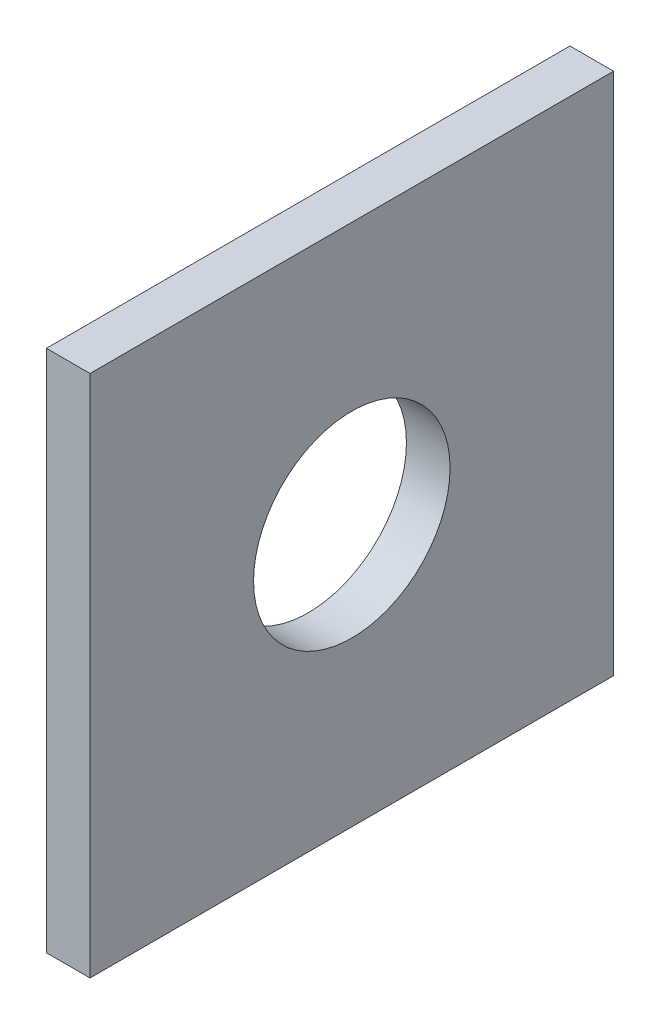
ISO-10303-21;
HEADER;
FILE_DESCRIPTION(('STEP AP214'),'2;1');
FILE_NAME('part.step','',(''),(''),'','','');
FILE_SCHEMA(('AUTOMOTIVE_DESIGN { 1 0 10303 214 1 1 1 1 }'));
ENDSEC;
DATA;
#1=APPLICATION_CONTEXT('core data for automotive mechanical design processes');
#2=APPLICATION_PROTOCOL_DEFINITION('international standard','automotive_design',2000,#1);
#3=PRODUCT_CONTEXT('',#1,'mechanical');
#4=PRODUCT('Part','Part','',(#3));
#5=PRODUCT_RELATED_PRODUCT_CATEGORY('part','',(#4));
#6=PRODUCT_DEFINITION_FORMATION('','',#4);
#7=PRODUCT_DEFINITION_CONTEXT('part definition',#1,'design');
#8=PRODUCT_DEFINITION('design','',#6,#7);
#9=PRODUCT_DEFINITION_SHAPE('','',#8);
#10=(LENGTH_UNIT() NAMED_UNIT(*) SI_UNIT(.MILLI.,.METRE.));
#11=(NAMED_UNIT(*) PLANE_ANGLE_UNIT() SI_UNIT($,.RADIAN.));
#12=(NAMED_UNIT(*) SI_UNIT($,.STERADIAN.) SOLID_ANGLE_UNIT());
#13=UNCERTAINTY_MEASURE_WITH_UNIT(LENGTH_MEASURE(1.E-05),#10,'distance_accuracy_value','');
#14=(GEOMETRIC_REPRESENTATION_CONTEXT(3) GLOBAL_UNCERTAINTY_ASSIGNED_CONTEXT((#13)) GLOBAL_UNIT_ASSIGNED_CONTEXT((#10,
#11,#12)) REPRESENTATION_CONTEXT('',''));
#15=CARTESIAN_POINT('',(0.,0.,0.));
#16=DIRECTION('',(0.,0.,1.));
#17=DIRECTION('',(1.,0.,0.));
#18=AXIS2_PLACEMENT_3D('',#15,#16,#17);
#19=CARTESIAN_POINT('',(-74.295,57.2820627876655,-19.05));
#20=DIRECTION('',(0.,0.,1.));
#21=DIRECTION('',(1.,0.,0.));
#22=AXIS2_PLACEMENT_3D('',#19,#20,#21);
#23=PLANE('',#22);
#24=DIRECTION('',(-1.,0.,0.));
#25=VECTOR('',#24,1.);
#26=CARTESIAN_POINT('',(-74.295,19.05,-19.05));
#27=LINE('',#26,#25);
#28=CARTESIAN_POINT('',(-71.12,19.05,-19.05));
#29=VERTEX_POINT('',#28);
#30=CARTESIAN_POINT('',(-74.295,19.05,-19.05));
#31=VERTEX_POINT('',#30);
#32=EDGE_CURVE('E106',#29,#31,#27,.T.);
#33=ORIENTED_EDGE('',*,*,#32,.F.);
#34=DIRECTION('',(0.,-1.,0.));
#35=VECTOR('',#34,1.);
#36=CARTESIAN_POINT('',(-71.12,57.2820627876655,-19.05));
#37=LINE('',#36,#35);
#38=CARTESIAN_POINT('',(-71.12,-19.05,-19.05));
#39=VERTEX_POINT('',#38);
#40=EDGE_CURVE('E43',#29,#39,#37,.T.);
#41=ORIENTED_EDGE('',*,*,#40,.T.);
#42=DIRECTION('',(1.,0.,0.));
#43=VECTOR('',#42,1.);
#44=CARTESIAN_POINT('',(-74.295,-19.05,-19.05));
#45=LINE('',#44,#43);
#46=CARTESIAN_POINT('',(-74.295,-19.05,-19.05));
#47=VERTEX_POINT('',#46);
#48=EDGE_CURVE('E100',#47,#39,#45,.T.);
#49=ORIENTED_EDGE('',*,*,#48,.F.);
#50=DIRECTION('',(0.,-1.,0.));
#51=VECTOR('',#50,1.);
#52=CARTESIAN_POINT('',(-74.295,57.2820627876655,-19.05));
#53=LINE('',#52,#51);
#54=EDGE_CURVE('E88',#31,#47,#53,.T.);
#55=ORIENTED_EDGE('',*,*,#54,.F.);
#56=EDGE_LOOP('',(#33,#41,#49,#55));
#57=FACE_BOUND('',#56,.T.);
#58=ADVANCED_FACE('F39',(#57),#23,.F.);
#59=CARTESIAN_POINT('',(-74.295,57.2820627876655,-19.05));
#60=DIRECTION('',(1.,0.,0.));
#61=DIRECTION('',(0.,0.,-1.));
#62=AXIS2_PLACEMENT_3D('',#59,#60,#61);
#63=PLANE('',#62);
#64=CARTESIAN_POINT('',(-74.295,0.,0.));
#65=DIRECTION('',(1.,0.,0.));
#66=DIRECTION('',(0.,0.,-1.));
#67=AXIS2_PLACEMENT_3D('',#64,#65,#66);
#68=CIRCLE('',#67,7.1501);
#69=CARTESIAN_POINT('',(-74.295,0.,-7.1501));
#70=VERTEX_POINT('',#69);
#71=EDGE_CURVE('E97',#70,#70,#68,.F.);
#72=ORIENTED_EDGE('',*,*,#71,.F.);
#73=EDGE_LOOP('',(#72));
#74=FACE_BOUND('',#73,.T.);
#75=DIRECTION('',(0.,0.,1.));
#76=VECTOR('',#75,1.);
#77=CARTESIAN_POINT('',(-74.295,19.05,-19.05));
#78=LINE('',#77,#76);
#79=CARTESIAN_POINT('',(-74.295,19.05,19.05));
#80=VERTEX_POINT('',#79);
#81=EDGE_CURVE('E48',#31,#80,#78,.T.);
#82=ORIENTED_EDGE('',*,*,#81,.F.);
#83=ORIENTED_EDGE('',*,*,#54,.T.);
#84=DIRECTION('',(0.,0.,-1.));
#85=VECTOR('',#84,1.);
#86=CARTESIAN_POINT('',(-74.295,-19.05,-19.05));
#87=LINE('',#86,#85);
#88=CARTESIAN_POINT('',(-74.295,-19.05,19.05));
#89=VERTEX_POINT('',#88);
#90=EDGE_CURVE('E94',#89,#47,#87,.T.);
#91=ORIENTED_EDGE('',*,*,#90,.F.);
#92=DIRECTION('',(0.,-1.,0.));
#93=VECTOR('',#92,1.);
#94=CARTESIAN_POINT('',(-74.295,57.2820627876655,19.05));
#95=LINE('',#94,#93);
#96=EDGE_CURVE('E83',#80,#89,#95,.T.);
#97=ORIENTED_EDGE('',*,*,#96,.F.);
#98=EDGE_LOOP('',(#82,#83,#91,#97));
#99=FACE_BOUND('',#98,.T.);
#100=ADVANCED_FACE('F99',(#74,#99),#63,.F.);
#101=CARTESIAN_POINT('',(-74.295,57.2820627876655,19.05));
#102=DIRECTION('',(0.,0.,-1.));
#103=DIRECTION('',(-1.,0.,0.));
#104=AXIS2_PLACEMENT_3D('',#101,#102,#103);
#105=PLANE('',#104);
#106=DIRECTION('',(1.,0.,0.));
#107=VECTOR('',#106,1.);
#108=CARTESIAN_POINT('',(-74.295,19.05,19.05));
#109=LINE('',#108,#107);
#110=CARTESIAN_POINT('',(-71.12,19.05,19.05));
#111=VERTEX_POINT('',#110);
#112=EDGE_CURVE('E11',#80,#111,#109,.T.);
#113=ORIENTED_EDGE('',*,*,#112,.F.);
#114=ORIENTED_EDGE('',*,*,#96,.T.);
#115=DIRECTION('',(-1.,0.,0.));
#116=VECTOR('',#115,1.);
#117=CARTESIAN_POINT('',(-74.295,-19.05,19.05));
#118=LINE('',#117,#116);
#119=CARTESIAN_POINT('',(-71.12,-19.05,19.05));
#120=VERTEX_POINT('',#119);
#121=EDGE_CURVE('E86',#120,#89,#118,.T.);
#122=ORIENTED_EDGE('',*,*,#121,.F.);
#123=DIRECTION('',(0.,-1.,0.));
#124=VECTOR('',#123,1.);
#125=CARTESIAN_POINT('',(-71.12,57.2820627876655,19.05));
#126=LINE('',#125,#124);
#127=EDGE_CURVE('E64',#111,#120,#126,.T.);
#128=ORIENTED_EDGE('',*,*,#127,.F.);
#129=EDGE_LOOP('',(#113,#114,#122,#128));
#130=FACE_BOUND('',#129,.T.);
#131=ADVANCED_FACE('F85',(#130),#105,.F.);
#132=CARTESIAN_POINT('',(-71.12,57.2820627876655,-19.05));
#133=DIRECTION('',(-1.,0.,0.));
#134=DIRECTION('',(0.,0.,1.));
#135=AXIS2_PLACEMENT_3D('',#132,#133,#134);
#136=PLANE('',#135);
#137=CARTESIAN_POINT('',(-71.12,0.,0.));
#138=DIRECTION('',(1.,0.,0.));
#139=DIRECTION('',(0.,0.,-1.));
#140=AXIS2_PLACEMENT_3D('',#137,#138,#139);
#141=CIRCLE('',#140,7.1501);
#142=CARTESIAN_POINT('',(-71.12,0.,-7.1501));
#143=VERTEX_POINT('',#142);
#144=EDGE_CURVE('E135',#143,#143,#141,.T.);
#145=ORIENTED_EDGE('',*,*,#144,.F.);
#146=EDGE_LOOP('',(#145));
#147=FACE_BOUND('',#146,.T.);
#148=DIRECTION('',(0.,0.,-1.));
#149=VECTOR('',#148,1.);
#150=CARTESIAN_POINT('',(-71.12,19.05,-19.05));
#151=LINE('',#150,#149);
#152=EDGE_CURVE('E109',#111,#29,#151,.T.);
#153=ORIENTED_EDGE('',*,*,#152,.F.);
#154=ORIENTED_EDGE('',*,*,#127,.T.);
#155=DIRECTION('',(0.,0.,1.));
#156=VECTOR('',#155,1.);
#157=CARTESIAN_POINT('',(-71.12,-19.05,-19.05));
#158=LINE('',#157,#156);
#159=EDGE_CURVE('E96',#39,#120,#158,.T.);
#160=ORIENTED_EDGE('',*,*,#159,.F.);
#161=ORIENTED_EDGE('',*,*,#40,.F.);
#162=EDGE_LOOP('',(#153,#154,#160,#161));
#163=FACE_BOUND('',#162,.T.);
#164=ADVANCED_FACE('F113',(#147,#163),#136,.F.);
#165=CARTESIAN_POINT('',(0.,19.05,0.));
#166=DIRECTION('',(0.,1.,0.));
#167=DIRECTION('',(0.,0.,1.));
#168=AXIS2_PLACEMENT_3D('',#165,#166,#167);
#169=PLANE('',#168);
#170=ORIENTED_EDGE('',*,*,#152,.T.);
#171=ORIENTED_EDGE('',*,*,#32,.T.);
#172=ORIENTED_EDGE('',*,*,#81,.T.);
#173=ORIENTED_EDGE('',*,*,#112,.T.);
#174=EDGE_LOOP('',(#170,#171,#172,#173));
#175=FACE_BOUND('',#174,.T.);
#176=ADVANCED_FACE('F41',(#175),#169,.T.);
#177=CARTESIAN_POINT('',(0.,-19.05,0.));
#178=DIRECTION('',(0.,1.,0.));
#179=DIRECTION('',(0.,0.,1.));
#180=AXIS2_PLACEMENT_3D('',#177,#178,#179);
#181=PLANE('',#180);
#182=ORIENTED_EDGE('',*,*,#48,.T.);
#183=ORIENTED_EDGE('',*,*,#159,.T.);
#184=ORIENTED_EDGE('',*,*,#121,.T.);
#185=ORIENTED_EDGE('',*,*,#90,.T.);
#186=EDGE_LOOP('',(#182,#183,#184,#185));
#187=FACE_BOUND('',#186,.T.);
#188=ADVANCED_FACE('F93',(#187),#181,.F.);
#189=CARTESIAN_POINT('',(-94.5185367846477,0.,0.));
#190=DIRECTION('',(1.,0.,0.));
#191=DIRECTION('',(0.,0.,-1.));
#192=AXIS2_PLACEMENT_3D('',#189,#190,#191);
#193=CYLINDRICAL_SURFACE('',#192,7.1501);
#194=ORIENTED_EDGE('',*,*,#71,.T.);
#195=EDGE_LOOP('',(#194));
#196=FACE_BOUND('',#195,.T.);
#197=ORIENTED_EDGE('',*,*,#144,.T.);
#198=EDGE_LOOP('',(#197));
#199=FACE_BOUND('',#198,.T.);
#200=ADVANCED_FACE('F138',(#196,#199),#193,.F.);
#201=CLOSED_SHELL('',(#58,#100,#131,#164,#176,#188,#200));
#202=MANIFOLD_SOLID_BREP('B2',#201);
#203=ADVANCED_BREP_SHAPE_REPRESENTATION('',(#18,#202),#14);
#204=SHAPE_DEFINITION_REPRESENTATION(#9,#203);
ENDSEC;
END-ISO-10303-21;
